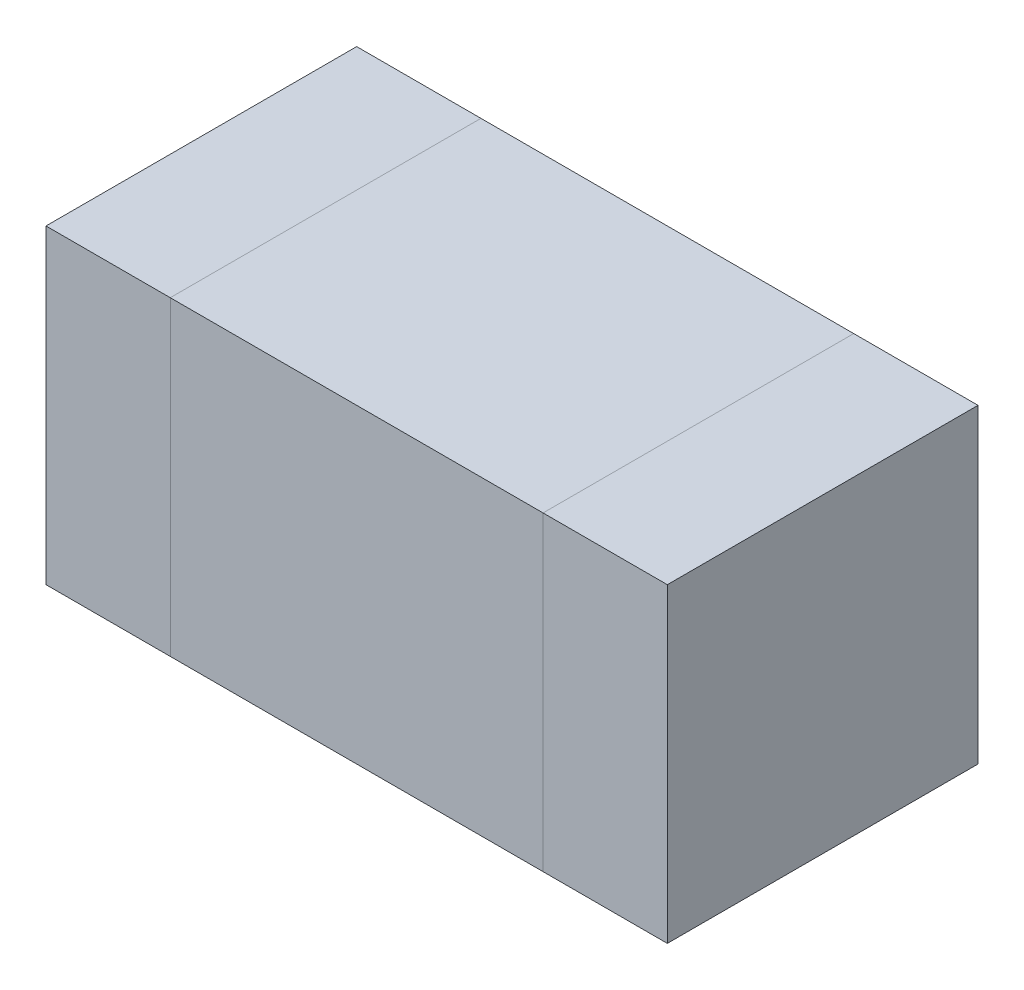
ISO-10303-21;
HEADER;
FILE_DESCRIPTION(('STEP AP214'),'2;1');
FILE_NAME('part.step','',(''),(''),'','','');
FILE_SCHEMA(('AUTOMOTIVE_DESIGN { 1 0 10303 214 1 1 1 1 }'));
ENDSEC;
DATA;
#1=APPLICATION_CONTEXT('core data for automotive mechanical design processes');
#2=APPLICATION_PROTOCOL_DEFINITION('international standard','automotive_design',2000,#1);
#3=PRODUCT_CONTEXT('',#1,'mechanical');
#4=PRODUCT('Part','Part','',(#3));
#5=PRODUCT_RELATED_PRODUCT_CATEGORY('part','',(#4));
#6=PRODUCT_DEFINITION_FORMATION('','',#4);
#7=PRODUCT_DEFINITION_CONTEXT('part definition',#1,'design');
#8=PRODUCT_DEFINITION('design','',#6,#7);
#9=PRODUCT_DEFINITION_SHAPE('','',#8);
#10=(LENGTH_UNIT() NAMED_UNIT(*) SI_UNIT(.MILLI.,.METRE.));
#11=(NAMED_UNIT(*) PLANE_ANGLE_UNIT() SI_UNIT($,.RADIAN.));
#12=(NAMED_UNIT(*) SI_UNIT($,.STERADIAN.) SOLID_ANGLE_UNIT());
#13=UNCERTAINTY_MEASURE_WITH_UNIT(LENGTH_MEASURE(1.E-05),#10,'distance_accuracy_value','');
#14=(GEOMETRIC_REPRESENTATION_CONTEXT(3) GLOBAL_UNCERTAINTY_ASSIGNED_CONTEXT((#13)) GLOBAL_UNIT_ASSIGNED_CONTEXT((#10,
#11,#12)) REPRESENTATION_CONTEXT('',''));
#15=CARTESIAN_POINT('',(0.,0.,0.));
#16=DIRECTION('',(0.,0.,1.));
#17=DIRECTION('',(1.,0.,0.));
#18=AXIS2_PLACEMENT_3D('',#15,#16,#17);
#19=CARTESIAN_POINT('',(0.3,0.5,0.));
#20=DIRECTION('',(1.,0.,0.));
#21=DIRECTION('',(0.,0.,-1.));
#22=AXIS2_PLACEMENT_3D('',#19,#20,#21);
#23=PLANE('',#22);
#24=DIRECTION('',(0.,1.,0.));
#25=VECTOR('',#24,1.);
#26=CARTESIAN_POINT('',(0.3,0.5,0.25));
#27=LINE('',#26,#25);
#28=CARTESIAN_POINT('',(0.3,0.,0.25));
#29=VERTEX_POINT('',#28);
#30=CARTESIAN_POINT('',(0.3,0.5,0.25));
#31=VERTEX_POINT('',#30);
#32=EDGE_CURVE('P0_E78',#29,#31,#27,.T.);
#33=ORIENTED_EDGE('',*,*,#32,.T.);
#34=DIRECTION('',(0.,0.,1.));
#35=VECTOR('',#34,1.);
#36=CARTESIAN_POINT('',(0.3,0.5,0.));
#37=LINE('',#36,#35);
#38=CARTESIAN_POINT('',(0.3,0.5,-0.25));
#39=VERTEX_POINT('',#38);
#40=EDGE_CURVE('P0_E67',#39,#31,#37,.T.);
#41=ORIENTED_EDGE('',*,*,#40,.F.);
#42=DIRECTION('',(0.,1.,0.));
#43=VECTOR('',#42,1.);
#44=CARTESIAN_POINT('',(0.3,0.5,-0.25));
#45=LINE('',#44,#43);
#46=CARTESIAN_POINT('',(0.3,0.,-0.25));
#47=VERTEX_POINT('',#46);
#48=EDGE_CURVE('P0_E55',#47,#39,#45,.T.);
#49=ORIENTED_EDGE('',*,*,#48,.F.);
#50=DIRECTION('',(0.,0.,1.));
#51=VECTOR('',#50,1.);
#52=CARTESIAN_POINT('',(0.3,0.,0.));
#53=LINE('',#52,#51);
#54=EDGE_CURVE('P0_E19',#47,#29,#53,.T.);
#55=ORIENTED_EDGE('',*,*,#54,.T.);
#56=EDGE_LOOP('',(#33,#41,#49,#55));
#57=FACE_BOUND('',#56,.T.);
#58=ADVANCED_FACE('P0_F16',(#57),#23,.F.);
#59=CARTESIAN_POINT('',(0.,0.,0.));
#60=DIRECTION('',(0.,1.,0.));
#61=DIRECTION('',(0.,0.,1.));
#62=AXIS2_PLACEMENT_3D('',#59,#60,#61);
#63=PLANE('',#62);
#64=DIRECTION('',(-1.,0.,0.));
#65=VECTOR('',#64,1.);
#66=CARTESIAN_POINT('',(0.,0.,0.25));
#67=LINE('',#66,#65);
#68=CARTESIAN_POINT('',(0.5,0.,0.25));
#69=VERTEX_POINT('',#68);
#70=EDGE_CURVE('P0_E64',#69,#29,#67,.T.);
#71=ORIENTED_EDGE('',*,*,#70,.T.);
#72=ORIENTED_EDGE('',*,*,#54,.F.);
#73=DIRECTION('',(-1.,0.,0.));
#74=VECTOR('',#73,1.);
#75=CARTESIAN_POINT('',(0.,0.,-0.25));
#76=LINE('',#75,#74);
#77=CARTESIAN_POINT('',(0.5,0.,-0.25));
#78=VERTEX_POINT('',#77);
#79=EDGE_CURVE('P0_E61',#78,#47,#76,.T.);
#80=ORIENTED_EDGE('',*,*,#79,.F.);
#81=DIRECTION('',(0.,0.,-1.));
#82=VECTOR('',#81,1.);
#83=CARTESIAN_POINT('',(0.5,0.,0.));
#84=LINE('',#83,#82);
#85=EDGE_CURVE('P0_E82',#69,#78,#84,.T.);
#86=ORIENTED_EDGE('',*,*,#85,.F.);
#87=EDGE_LOOP('',(#71,#72,#80,#86));
#88=FACE_BOUND('',#87,.T.);
#89=ADVANCED_FACE('P0_F60',(#88),#63,.F.);
#90=CARTESIAN_POINT('',(0.,0.5,-0.25));
#91=DIRECTION('',(0.,0.,-1.));
#92=DIRECTION('',(-1.,0.,0.));
#93=AXIS2_PLACEMENT_3D('',#90,#91,#92);
#94=PLANE('',#93);
#95=DIRECTION('',(1.,0.,0.));
#96=VECTOR('',#95,1.);
#97=CARTESIAN_POINT('',(0.,0.5,-0.25));
#98=LINE('',#97,#96);
#99=CARTESIAN_POINT('',(0.5,0.5,-0.25));
#100=VERTEX_POINT('',#99);
#101=EDGE_CURVE('P0_E69',#100,#39,#98,.F.);
#102=ORIENTED_EDGE('',*,*,#101,.F.);
#103=DIRECTION('',(0.,1.,0.));
#104=VECTOR('',#103,1.);
#105=CARTESIAN_POINT('',(0.5,0.5,-0.25));
#106=LINE('',#105,#104);
#107=EDGE_CURVE('P0_E73',#78,#100,#106,.T.);
#108=ORIENTED_EDGE('',*,*,#107,.F.);
#109=ORIENTED_EDGE('',*,*,#79,.T.);
#110=ORIENTED_EDGE('',*,*,#48,.T.);
#111=EDGE_LOOP('',(#102,#108,#109,#110));
#112=FACE_BOUND('',#111,.T.);
#113=ADVANCED_FACE('P0_F71',(#112),#94,.T.);
#114=CARTESIAN_POINT('',(0.,0.5,0.));
#115=DIRECTION('',(0.,1.,0.));
#116=DIRECTION('',(0.,0.,1.));
#117=AXIS2_PLACEMENT_3D('',#114,#115,#116);
#118=PLANE('',#117);
#119=ORIENTED_EDGE('',*,*,#40,.T.);
#120=DIRECTION('',(-1.,0.,0.));
#121=VECTOR('',#120,1.);
#122=CARTESIAN_POINT('',(0.,0.5,0.25));
#123=LINE('',#122,#121);
#124=CARTESIAN_POINT('',(0.5,0.5,0.25));
#125=VERTEX_POINT('',#124);
#126=EDGE_CURVE('P0_E34',#31,#125,#123,.F.);
#127=ORIENTED_EDGE('',*,*,#126,.T.);
#128=DIRECTION('',(0.,0.,-1.));
#129=VECTOR('',#128,1.);
#130=CARTESIAN_POINT('',(0.5,0.5,0.));
#131=LINE('',#130,#129);
#132=EDGE_CURVE('P0_E25',#100,#125,#131,.F.);
#133=ORIENTED_EDGE('',*,*,#132,.F.);
#134=ORIENTED_EDGE('',*,*,#101,.T.);
#135=EDGE_LOOP('',(#119,#127,#133,#134));
#136=FACE_BOUND('',#135,.T.);
#137=ADVANCED_FACE('P0_F88',(#136),#118,.T.);
#138=CARTESIAN_POINT('',(0.,0.5,0.25));
#139=DIRECTION('',(0.,0.,-1.));
#140=DIRECTION('',(-1.,0.,0.));
#141=AXIS2_PLACEMENT_3D('',#138,#139,#140);
#142=PLANE('',#141);
#143=DIRECTION('',(0.,1.,0.));
#144=VECTOR('',#143,1.);
#145=CARTESIAN_POINT('',(0.5,0.5,0.25));
#146=LINE('',#145,#144);
#147=EDGE_CURVE('P0_E11',#125,#69,#146,.F.);
#148=ORIENTED_EDGE('',*,*,#147,.F.);
#149=ORIENTED_EDGE('',*,*,#126,.F.);
#150=ORIENTED_EDGE('',*,*,#32,.F.);
#151=ORIENTED_EDGE('',*,*,#70,.F.);
#152=EDGE_LOOP('',(#148,#149,#150,#151));
#153=FACE_BOUND('',#152,.T.);
#154=ADVANCED_FACE('P0_F90',(#153),#142,.F.);
#155=CARTESIAN_POINT('',(0.5,0.5,0.));
#156=DIRECTION('',(1.,0.,0.));
#157=DIRECTION('',(0.,0.,-1.));
#158=AXIS2_PLACEMENT_3D('',#155,#156,#157);
#159=PLANE('',#158);
#160=ORIENTED_EDGE('',*,*,#132,.T.);
#161=ORIENTED_EDGE('',*,*,#147,.T.);
#162=ORIENTED_EDGE('',*,*,#85,.T.);
#163=ORIENTED_EDGE('',*,*,#107,.T.);
#164=EDGE_LOOP('',(#160,#161,#162,#163));
#165=FACE_BOUND('',#164,.T.);
#166=ADVANCED_FACE('P0_F87',(#165),#159,.T.);
#167=CLOSED_SHELL('',(#58,#89,#113,#137,#154,#166));
#168=MANIFOLD_SOLID_BREP('P0_B1',#167);
#169=CARTESIAN_POINT('',(-0.3,0.5,0.));
#170=DIRECTION('',(1.,0.,0.));
#171=DIRECTION('',(0.,0.,-1.));
#172=AXIS2_PLACEMENT_3D('',#169,#170,#171);
#173=PLANE('',#172);
#174=DIRECTION('',(0.,0.,1.));
#175=VECTOR('',#174,1.);
#176=CARTESIAN_POINT('',(-0.3,0.5,0.));
#177=LINE('',#176,#175);
#178=CARTESIAN_POINT('',(-0.3,0.5,0.25));
#179=VERTEX_POINT('',#178);
#180=CARTESIAN_POINT('',(-0.3,0.5,-0.25));
#181=VERTEX_POINT('',#180);
#182=EDGE_CURVE('P1_E58',#179,#181,#177,.F.);
#183=ORIENTED_EDGE('',*,*,#182,.F.);
#184=DIRECTION('',(0.,1.,0.));
#185=VECTOR('',#184,1.);
#186=CARTESIAN_POINT('',(-0.3,0.5,0.25));
#187=LINE('',#186,#185);
#188=CARTESIAN_POINT('',(-0.3,0.,0.25));
#189=VERTEX_POINT('',#188);
#190=EDGE_CURVE('P1_E52',#189,#179,#187,.T.);
#191=ORIENTED_EDGE('',*,*,#190,.F.);
#192=DIRECTION('',(0.,0.,1.));
#193=VECTOR('',#192,1.);
#194=CARTESIAN_POINT('',(-0.3,0.,0.));
#195=LINE('',#194,#193);
#196=CARTESIAN_POINT('',(-0.3,0.,-0.25));
#197=VERTEX_POINT('',#196);
#198=EDGE_CURVE('P1_E60',#189,#197,#195,.F.);
#199=ORIENTED_EDGE('',*,*,#198,.T.);
#200=DIRECTION('',(0.,1.,0.));
#201=VECTOR('',#200,1.);
#202=CARTESIAN_POINT('',(-0.3,0.5,-0.25));
#203=LINE('',#202,#201);
#204=EDGE_CURVE('P1_E19',#197,#181,#203,.T.);
#205=ORIENTED_EDGE('',*,*,#204,.T.);
#206=EDGE_LOOP('',(#183,#191,#199,#205));
#207=FACE_BOUND('',#206,.T.);
#208=ADVANCED_FACE('P1_F16',(#207),#173,.T.);
#209=CARTESIAN_POINT('',(0.,0.5,-0.25));
#210=DIRECTION('',(0.,0.,1.));
#211=DIRECTION('',(1.,0.,0.));
#212=AXIS2_PLACEMENT_3D('',#209,#210,#211);
#213=PLANE('',#212);
#214=DIRECTION('',(0.,1.,0.));
#215=VECTOR('',#214,1.);
#216=CARTESIAN_POINT('',(-0.5,0.5,-0.25));
#217=LINE('',#216,#215);
#218=CARTESIAN_POINT('',(-0.5,0.,-0.25));
#219=VERTEX_POINT('',#218);
#220=CARTESIAN_POINT('',(-0.5,0.5,-0.25));
#221=VERTEX_POINT('',#220);
#222=EDGE_CURVE('P1_E74',#219,#221,#217,.T.);
#223=ORIENTED_EDGE('',*,*,#222,.T.);
#224=DIRECTION('',(1.,0.,0.));
#225=VECTOR('',#224,1.);
#226=CARTESIAN_POINT('',(0.,0.5,-0.25));
#227=LINE('',#226,#225);
#228=EDGE_CURVE('P1_E65',#181,#221,#227,.F.);
#229=ORIENTED_EDGE('',*,*,#228,.F.);
#230=ORIENTED_EDGE('',*,*,#204,.F.);
#231=DIRECTION('',(1.,0.,0.));
#232=VECTOR('',#231,1.);
#233=CARTESIAN_POINT('',(0.,0.,-0.25));
#234=LINE('',#233,#232);
#235=EDGE_CURVE('P1_E80',#197,#219,#234,.F.);
#236=ORIENTED_EDGE('',*,*,#235,.T.);
#237=EDGE_LOOP('',(#223,#229,#230,#236));
#238=FACE_BOUND('',#237,.T.);
#239=ADVANCED_FACE('P1_F73',(#238),#213,.F.);
#240=CARTESIAN_POINT('',(0.,0.5,0.));
#241=DIRECTION('',(0.,1.,0.));
#242=DIRECTION('',(0.,0.,1.));
#243=AXIS2_PLACEMENT_3D('',#240,#241,#242);
#244=PLANE('',#243);
#245=DIRECTION('',(1.,0.,0.));
#246=VECTOR('',#245,1.);
#247=CARTESIAN_POINT('',(0.,0.5,0.25));
#248=LINE('',#247,#246);
#249=CARTESIAN_POINT('',(-0.5,0.5,0.25));
#250=VERTEX_POINT('',#249);
#251=EDGE_CURVE('P1_E70',#179,#250,#248,.F.);
#252=ORIENTED_EDGE('',*,*,#251,.F.);
#253=ORIENTED_EDGE('',*,*,#182,.T.);
#254=ORIENTED_EDGE('',*,*,#228,.T.);
#255=DIRECTION('',(0.,0.,-1.));
#256=VECTOR('',#255,1.);
#257=CARTESIAN_POINT('',(-0.5,0.5,0.));
#258=LINE('',#257,#256);
#259=EDGE_CURVE('P1_E83',#221,#250,#258,.F.);
#260=ORIENTED_EDGE('',*,*,#259,.T.);
#261=EDGE_LOOP('',(#252,#253,#254,#260));
#262=FACE_BOUND('',#261,.T.);
#263=ADVANCED_FACE('P1_F67',(#262),#244,.T.);
#264=CARTESIAN_POINT('',(0.,0.5,0.25));
#265=DIRECTION('',(0.,0.,1.));
#266=DIRECTION('',(1.,0.,0.));
#267=AXIS2_PLACEMENT_3D('',#264,#265,#266);
#268=PLANE('',#267);
#269=ORIENTED_EDGE('',*,*,#251,.T.);
#270=DIRECTION('',(0.,1.,0.));
#271=VECTOR('',#270,1.);
#272=CARTESIAN_POINT('',(-0.5,0.5,0.25));
#273=LINE('',#272,#271);
#274=CARTESIAN_POINT('',(-0.5,0.,0.25));
#275=VERTEX_POINT('',#274);
#276=EDGE_CURVE('P1_E25',#250,#275,#273,.F.);
#277=ORIENTED_EDGE('',*,*,#276,.T.);
#278=DIRECTION('',(1.,0.,0.));
#279=VECTOR('',#278,1.);
#280=CARTESIAN_POINT('',(0.,0.,0.25));
#281=LINE('',#280,#279);
#282=EDGE_CURVE('P1_E33',#275,#189,#281,.T.);
#283=ORIENTED_EDGE('',*,*,#282,.T.);
#284=ORIENTED_EDGE('',*,*,#190,.T.);
#285=EDGE_LOOP('',(#269,#277,#283,#284));
#286=FACE_BOUND('',#285,.T.);
#287=ADVANCED_FACE('P1_F87',(#286),#268,.T.);
#288=CARTESIAN_POINT('',(0.,0.,0.));
#289=DIRECTION('',(0.,1.,0.));
#290=DIRECTION('',(0.,0.,1.));
#291=AXIS2_PLACEMENT_3D('',#288,#289,#290);
#292=PLANE('',#291);
#293=ORIENTED_EDGE('',*,*,#198,.F.);
#294=ORIENTED_EDGE('',*,*,#282,.F.);
#295=DIRECTION('',(0.,0.,-1.));
#296=VECTOR('',#295,1.);
#297=CARTESIAN_POINT('',(-0.5,0.,0.));
#298=LINE('',#297,#296);
#299=EDGE_CURVE('P1_E11',#275,#219,#298,.T.);
#300=ORIENTED_EDGE('',*,*,#299,.T.);
#301=ORIENTED_EDGE('',*,*,#235,.F.);
#302=EDGE_LOOP('',(#293,#294,#300,#301));
#303=FACE_BOUND('',#302,.T.);
#304=ADVANCED_FACE('P1_F90',(#303),#292,.F.);
#305=CARTESIAN_POINT('',(-0.5,0.5,0.));
#306=DIRECTION('',(1.,0.,0.));
#307=DIRECTION('',(0.,0.,-1.));
#308=AXIS2_PLACEMENT_3D('',#305,#306,#307);
#309=PLANE('',#308);
#310=ORIENTED_EDGE('',*,*,#276,.F.);
#311=ORIENTED_EDGE('',*,*,#259,.F.);
#312=ORIENTED_EDGE('',*,*,#222,.F.);
#313=ORIENTED_EDGE('',*,*,#299,.F.);
#314=EDGE_LOOP('',(#310,#311,#312,#313));
#315=FACE_BOUND('',#314,.T.);
#316=ADVANCED_FACE('P1_F89',(#315),#309,.F.);
#317=CLOSED_SHELL('',(#208,#239,#263,#287,#304,#316));
#318=MANIFOLD_SOLID_BREP('P1_B1',#317);
#319=CARTESIAN_POINT('',(0.,0.5,-0.25));
#320=DIRECTION('',(0.,0.,-1.));
#321=DIRECTION('',(-1.,0.,0.));
#322=AXIS2_PLACEMENT_3D('',#319,#320,#321);
#323=PLANE('',#322);
#324=DIRECTION('',(1.,0.,0.));
#325=VECTOR('',#324,1.);
#326=CARTESIAN_POINT('',(0.,0.5,-0.25));
#327=LINE('',#326,#325);
#328=CARTESIAN_POINT('',(0.3,0.5,-0.25));
#329=VERTEX_POINT('',#328);
#330=CARTESIAN_POINT('',(-0.3,0.5,-0.25));
#331=VERTEX_POINT('',#330);
#332=EDGE_CURVE('P2_E57',#329,#331,#327,.F.);
#333=ORIENTED_EDGE('',*,*,#332,.F.);
#334=DIRECTION('',(0.,1.,0.));
#335=VECTOR('',#334,1.);
#336=CARTESIAN_POINT('',(0.3,0.5,-0.25));
#337=LINE('',#336,#335);
#338=CARTESIAN_POINT('',(0.3,0.,-0.25));
#339=VERTEX_POINT('',#338);
#340=EDGE_CURVE('P2_E52',#339,#329,#337,.T.);
#341=ORIENTED_EDGE('',*,*,#340,.F.);
#342=DIRECTION('',(1.,0.,0.));
#343=VECTOR('',#342,1.);
#344=CARTESIAN_POINT('',(0.,0.,-0.25));
#345=LINE('',#344,#343);
#346=CARTESIAN_POINT('',(-0.3,0.,-0.25));
#347=VERTEX_POINT('',#346);
#348=EDGE_CURVE('P2_E67',#339,#347,#345,.F.);
#349=ORIENTED_EDGE('',*,*,#348,.T.);
#350=DIRECTION('',(0.,1.,0.));
#351=VECTOR('',#350,1.);
#352=CARTESIAN_POINT('',(-0.3,0.5,-0.25));
#353=LINE('',#352,#351);
#354=EDGE_CURVE('P2_E19',#347,#331,#353,.T.);
#355=ORIENTED_EDGE('',*,*,#354,.T.);
#356=EDGE_LOOP('',(#333,#341,#349,#355));
#357=FACE_BOUND('',#356,.T.);
#358=ADVANCED_FACE('P2_F16',(#357),#323,.T.);
#359=CARTESIAN_POINT('',(-0.3,0.5,0.));
#360=DIRECTION('',(1.,0.,0.));
#361=DIRECTION('',(0.,0.,-1.));
#362=AXIS2_PLACEMENT_3D('',#359,#360,#361);
#363=PLANE('',#362);
#364=DIRECTION('',(0.,1.,0.));
#365=VECTOR('',#364,1.);
#366=CARTESIAN_POINT('',(-0.3,0.5,0.25));
#367=LINE('',#366,#365);
#368=CARTESIAN_POINT('',(-0.3,0.,0.25));
#369=VERTEX_POINT('',#368);
#370=CARTESIAN_POINT('',(-0.3,0.5,0.25));
#371=VERTEX_POINT('',#370);
#372=EDGE_CURVE('P2_E73',#369,#371,#367,.T.);
#373=ORIENTED_EDGE('',*,*,#372,.T.);
#374=DIRECTION('',(0.,0.,1.));
#375=VECTOR('',#374,1.);
#376=CARTESIAN_POINT('',(-0.3,0.5,0.));
#377=LINE('',#376,#375);
#378=EDGE_CURVE('P2_E62',#331,#371,#377,.T.);
#379=ORIENTED_EDGE('',*,*,#378,.F.);
#380=ORIENTED_EDGE('',*,*,#354,.F.);
#381=DIRECTION('',(0.,0.,1.));
#382=VECTOR('',#381,1.);
#383=CARTESIAN_POINT('',(-0.3,0.,0.));
#384=LINE('',#383,#382);
#385=EDGE_CURVE('P2_E80',#347,#369,#384,.T.);
#386=ORIENTED_EDGE('',*,*,#385,.T.);
#387=EDGE_LOOP('',(#373,#379,#380,#386));
#388=FACE_BOUND('',#387,.T.);
#389=ADVANCED_FACE('P2_F72',(#388),#363,.F.);
#390=CARTESIAN_POINT('',(0.,0.5,0.));
#391=DIRECTION('',(0.,1.,0.));
#392=DIRECTION('',(0.,0.,1.));
#393=AXIS2_PLACEMENT_3D('',#390,#391,#392);
#394=PLANE('',#393);
#395=ORIENTED_EDGE('',*,*,#332,.T.);
#396=ORIENTED_EDGE('',*,*,#378,.T.);
#397=DIRECTION('',(-1.,0.,0.));
#398=VECTOR('',#397,1.);
#399=CARTESIAN_POINT('',(0.,0.5,0.25));
#400=LINE('',#399,#398);
#401=CARTESIAN_POINT('',(0.3,0.5,0.25));
#402=VERTEX_POINT('',#401);
#403=EDGE_CURVE('P2_E83',#371,#402,#400,.F.);
#404=ORIENTED_EDGE('',*,*,#403,.T.);
#405=DIRECTION('',(0.,0.,-1.));
#406=VECTOR('',#405,1.);
#407=CARTESIAN_POINT('',(0.3,0.5,0.));
#408=LINE('',#407,#406);
#409=EDGE_CURVE('P2_E64',#329,#402,#408,.F.);
#410=ORIENTED_EDGE('',*,*,#409,.F.);
#411=EDGE_LOOP('',(#395,#396,#404,#410));
#412=FACE_BOUND('',#411,.T.);
#413=ADVANCED_FACE('P2_F59',(#412),#394,.T.);
#414=CARTESIAN_POINT('',(0.3,0.5,0.));
#415=DIRECTION('',(1.,0.,0.));
#416=DIRECTION('',(0.,0.,-1.));
#417=AXIS2_PLACEMENT_3D('',#414,#415,#416);
#418=PLANE('',#417);
#419=ORIENTED_EDGE('',*,*,#409,.T.);
#420=DIRECTION('',(0.,1.,0.));
#421=VECTOR('',#420,1.);
#422=CARTESIAN_POINT('',(0.3,0.5,0.25));
#423=LINE('',#422,#421);
#424=CARTESIAN_POINT('',(0.3,0.,0.25));
#425=VERTEX_POINT('',#424);
#426=EDGE_CURVE('P2_E25',#402,#425,#423,.F.);
#427=ORIENTED_EDGE('',*,*,#426,.T.);
#428=DIRECTION('',(0.,0.,1.));
#429=VECTOR('',#428,1.);
#430=CARTESIAN_POINT('',(0.3,0.,0.));
#431=LINE('',#430,#429);
#432=EDGE_CURVE('P2_E33',#425,#339,#431,.F.);
#433=ORIENTED_EDGE('',*,*,#432,.T.);
#434=ORIENTED_EDGE('',*,*,#340,.T.);
#435=EDGE_LOOP('',(#419,#427,#433,#434));
#436=FACE_BOUND('',#435,.T.);
#437=ADVANCED_FACE('P2_F87',(#436),#418,.T.);
#438=CARTESIAN_POINT('',(0.,0.,0.));
#439=DIRECTION('',(0.,1.,0.));
#440=DIRECTION('',(0.,0.,1.));
#441=AXIS2_PLACEMENT_3D('',#438,#439,#440);
#442=PLANE('',#441);
#443=ORIENTED_EDGE('',*,*,#385,.F.);
#444=ORIENTED_EDGE('',*,*,#348,.F.);
#445=ORIENTED_EDGE('',*,*,#432,.F.);
#446=DIRECTION('',(-1.,0.,0.));
#447=VECTOR('',#446,1.);
#448=CARTESIAN_POINT('',(0.,0.,0.25));
#449=LINE('',#448,#447);
#450=EDGE_CURVE('P2_E11',#425,#369,#449,.T.);
#451=ORIENTED_EDGE('',*,*,#450,.T.);
#452=EDGE_LOOP('',(#443,#444,#445,#451));
#453=FACE_BOUND('',#452,.T.);
#454=ADVANCED_FACE('P2_F90',(#453),#442,.F.);
#455=CARTESIAN_POINT('',(0.,0.5,0.25));
#456=DIRECTION('',(0.,0.,-1.));
#457=DIRECTION('',(-1.,0.,0.));
#458=AXIS2_PLACEMENT_3D('',#455,#456,#457);
#459=PLANE('',#458);
#460=ORIENTED_EDGE('',*,*,#426,.F.);
#461=ORIENTED_EDGE('',*,*,#403,.F.);
#462=ORIENTED_EDGE('',*,*,#372,.F.);
#463=ORIENTED_EDGE('',*,*,#450,.F.);
#464=EDGE_LOOP('',(#460,#461,#462,#463));
#465=FACE_BOUND('',#464,.T.);
#466=ADVANCED_FACE('P2_F89',(#465),#459,.F.);
#467=CLOSED_SHELL('',(#358,#389,#413,#437,#454,#466));
#468=MANIFOLD_SOLID_BREP('P2_B1',#467);
#469=ADVANCED_BREP_SHAPE_REPRESENTATION('',(#18,#168,#318,#468),#14);
#470=SHAPE_DEFINITION_REPRESENTATION(#9,#469);
ENDSEC;
END-ISO-10303-21;
